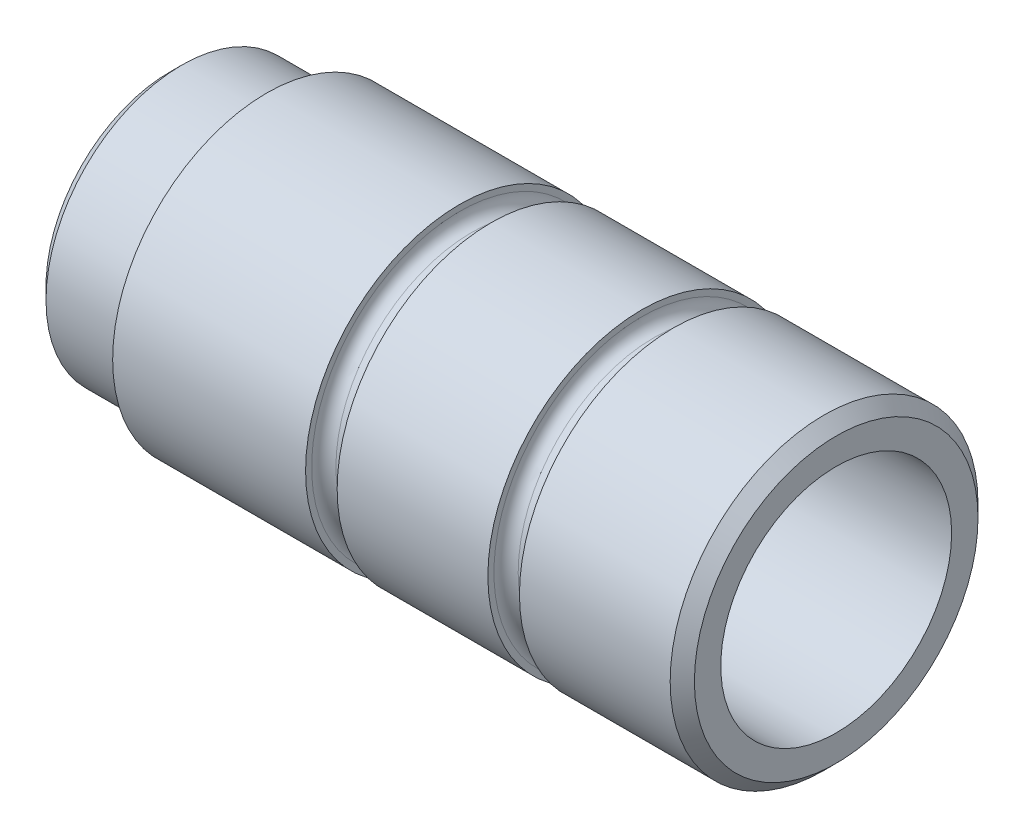
ISO-10303-21;
HEADER;
FILE_DESCRIPTION(('STEP AP214'),'2;1');
FILE_NAME('part.step','',(''),(''),'','','');
FILE_SCHEMA(('AUTOMOTIVE_DESIGN { 1 0 10303 214 1 1 1 1 }'));
ENDSEC;
DATA;
#1=APPLICATION_CONTEXT('core data for automotive mechanical design processes');
#2=APPLICATION_PROTOCOL_DEFINITION('international standard','automotive_design',2000,#1);
#3=PRODUCT_CONTEXT('',#1,'mechanical');
#4=PRODUCT('Part','Part','',(#3));
#5=PRODUCT_RELATED_PRODUCT_CATEGORY('part','',(#4));
#6=PRODUCT_DEFINITION_FORMATION('','',#4);
#7=PRODUCT_DEFINITION_CONTEXT('part definition',#1,'design');
#8=PRODUCT_DEFINITION('design','',#6,#7);
#9=PRODUCT_DEFINITION_SHAPE('','',#8);
#10=(LENGTH_UNIT() NAMED_UNIT(*) SI_UNIT(.MILLI.,.METRE.));
#11=(NAMED_UNIT(*) PLANE_ANGLE_UNIT() SI_UNIT($,.RADIAN.));
#12=(NAMED_UNIT(*) SI_UNIT($,.STERADIAN.) SOLID_ANGLE_UNIT());
#13=UNCERTAINTY_MEASURE_WITH_UNIT(LENGTH_MEASURE(1.E-05),#10,'distance_accuracy_value','');
#14=(GEOMETRIC_REPRESENTATION_CONTEXT(3) GLOBAL_UNCERTAINTY_ASSIGNED_CONTEXT((#13)) GLOBAL_UNIT_ASSIGNED_CONTEXT((#10,
#11,#12)) REPRESENTATION_CONTEXT('',''));
#15=CARTESIAN_POINT('',(0.,0.,0.));
#16=DIRECTION('',(0.,0.,1.));
#17=DIRECTION('',(1.,0.,0.));
#18=AXIS2_PLACEMENT_3D('',#15,#16,#17);
#19=CARTESIAN_POINT('',(0.,9.5249999999999,0.));
#20=DIRECTION('',(1.,0.,0.));
#21=DIRECTION('',(0.,0.,-1.));
#22=AXIS2_PLACEMENT_3D('',#19,#20,#21);
#23=PLANE('',#22);
#24=CARTESIAN_POINT('',(0.,0.,0.));
#25=DIRECTION('',(1.,0.,0.));
#26=DIRECTION('',(0.,0.,-1.));
#27=AXIS2_PLACEMENT_3D('',#24,#25,#26);
#28=CIRCLE('',#27,11.7);
#29=CARTESIAN_POINT('',(0.,0.,-11.7));
#30=VERTEX_POINT('',#29);
#31=EDGE_CURVE('E100',#30,#30,#28,.T.);
#32=ORIENTED_EDGE('',*,*,#31,.T.);
#33=EDGE_LOOP('',(#32));
#34=FACE_BOUND('',#33,.T.);
#35=CARTESIAN_POINT('',(0.,0.,0.));
#36=DIRECTION('',(1.,0.,0.));
#37=DIRECTION('',(0.,0.,-1.));
#38=AXIS2_PLACEMENT_3D('',#35,#36,#37);
#39=CIRCLE('',#38,9.525);
#40=CARTESIAN_POINT('',(0.,0.,-9.52499999999999));
#41=VERTEX_POINT('',#40);
#42=EDGE_CURVE('E10',#41,#41,#39,.T.);
#43=ORIENTED_EDGE('',*,*,#42,.F.);
#44=EDGE_LOOP('',(#43));
#45=FACE_BOUND('',#44,.T.);
#46=ADVANCED_FACE('F33',(#34,#45),#23,.T.);
#47=CARTESIAN_POINT('',(19.1682966546143,0.,0.));
#48=DIRECTION('',(1.,0.,0.));
#49=DIRECTION('',(0.,0.,-1.));
#50=AXIS2_PLACEMENT_3D('',#47,#48,#49);
#51=CYLINDRICAL_SURFACE('',#50,9.525);
#52=ORIENTED_EDGE('',*,*,#42,.T.);
#53=EDGE_LOOP('',(#52));
#54=FACE_BOUND('',#53,.T.);
#55=CARTESIAN_POINT('',(-54.9999999999999,0.,0.));
#56=DIRECTION('',(1.,0.,0.));
#57=DIRECTION('',(0.,0.,-1.));
#58=AXIS2_PLACEMENT_3D('',#55,#56,#57);
#59=CIRCLE('',#58,9.52499999999999);
#60=CARTESIAN_POINT('',(-54.9999999999999,0.,-9.52499999999999));
#61=VERTEX_POINT('',#60);
#62=EDGE_CURVE('E39',#61,#61,#59,.T.);
#63=ORIENTED_EDGE('',*,*,#62,.F.);
#64=EDGE_LOOP('',(#63));
#65=FACE_BOUND('',#64,.T.);
#66=ADVANCED_FACE('F118',(#54,#65),#51,.F.);
#67=CARTESIAN_POINT('',(-55.0000000000003,10.1999999999999,0.));
#68=DIRECTION('',(-1.,0.,0.));
#69=DIRECTION('',(0.,0.,1.));
#70=AXIS2_PLACEMENT_3D('',#67,#68,#69);
#71=PLANE('',#70);
#72=ORIENTED_EDGE('',*,*,#62,.T.);
#73=EDGE_LOOP('',(#72));
#74=FACE_BOUND('',#73,.T.);
#75=CARTESIAN_POINT('',(-54.9999999999999,0.,0.));
#76=DIRECTION('',(1.,0.,0.));
#77=DIRECTION('',(0.,0.,-1.));
#78=AXIS2_PLACEMENT_3D('',#75,#76,#77);
#79=CIRCLE('',#78,10.2);
#80=CARTESIAN_POINT('',(-54.9999999999999,0.,-10.2));
#81=VERTEX_POINT('',#80);
#82=EDGE_CURVE('E43',#81,#81,#79,.T.);
#83=ORIENTED_EDGE('',*,*,#82,.F.);
#84=EDGE_LOOP('',(#83));
#85=FACE_BOUND('',#84,.T.);
#86=ADVANCED_FACE('F122',(#74,#85),#71,.T.);
#87=CARTESIAN_POINT('',(-54.,0.,0.));
#88=DIRECTION('',(1.,0.,0.));
#89=DIRECTION('',(0.,0.,-1.));
#90=AXIS2_PLACEMENT_3D('',#87,#88,#89);
#91=CONICAL_SURFACE('',#90,11.2,0.785398163397447);
#92=ORIENTED_EDGE('',*,*,#82,.T.);
#93=EDGE_LOOP('',(#92));
#94=FACE_BOUND('',#93,.T.);
#95=CARTESIAN_POINT('',(-54.,0.,0.));
#96=DIRECTION('',(1.,0.,0.));
#97=DIRECTION('',(0.,0.,-1.));
#98=AXIS2_PLACEMENT_3D('',#95,#96,#97);
#99=CIRCLE('',#98,11.2);
#100=CARTESIAN_POINT('',(-54.,0.,-11.2));
#101=VERTEX_POINT('',#100);
#102=EDGE_CURVE('E47',#101,#101,#99,.T.);
#103=ORIENTED_EDGE('',*,*,#102,.F.);
#104=EDGE_LOOP('',(#103));
#105=FACE_BOUND('',#104,.T.);
#106=ADVANCED_FACE('F126',(#94,#105),#91,.T.);
#107=CARTESIAN_POINT('',(19.1682966546143,0.,0.));
#108=DIRECTION('',(1.,0.,0.));
#109=DIRECTION('',(0.,0.,-1.));
#110=AXIS2_PLACEMENT_3D('',#107,#108,#109);
#111=CYLINDRICAL_SURFACE('',#110,11.2);
#112=ORIENTED_EDGE('',*,*,#102,.T.);
#113=EDGE_LOOP('',(#112));
#114=FACE_BOUND('',#113,.T.);
#115=CARTESIAN_POINT('',(-47.9999999999999,0.,0.));
#116=DIRECTION('',(1.,0.,0.));
#117=DIRECTION('',(0.,0.,-1.));
#118=AXIS2_PLACEMENT_3D('',#115,#116,#117);
#119=CIRCLE('',#118,11.2);
#120=CARTESIAN_POINT('',(-47.9999999999999,0.,-11.2));
#121=VERTEX_POINT('',#120);
#122=EDGE_CURVE('E52',#121,#121,#119,.T.);
#123=ORIENTED_EDGE('',*,*,#122,.F.);
#124=EDGE_LOOP('',(#123));
#125=FACE_BOUND('',#124,.T.);
#126=ADVANCED_FACE('F132',(#114,#125),#111,.T.);
#127=CARTESIAN_POINT('',(-47.9999999999999,0.,0.));
#128=DIRECTION('',(1.,0.,0.));
#129=DIRECTION('',(0.,0.,-1.));
#130=AXIS2_PLACEMENT_3D('',#127,#128,#129);
#131=TOROIDAL_SURFACE('',#130,12.2,0.999999999999997);
#132=ORIENTED_EDGE('',*,*,#122,.T.);
#133=EDGE_LOOP('',(#132));
#134=FACE_BOUND('',#133,.T.);
#135=CARTESIAN_POINT('',(-47.0000000000002,0.,0.));
#136=DIRECTION('',(1.,0.,0.));
#137=DIRECTION('',(0.,0.,-1.));
#138=AXIS2_PLACEMENT_3D('',#135,#136,#137);
#139=CIRCLE('',#138,12.2);
#140=CARTESIAN_POINT('',(-47.0000000000002,0.,-12.1999999999999));
#141=VERTEX_POINT('',#140);
#142=EDGE_CURVE('E55',#141,#141,#139,.T.);
#143=ORIENTED_EDGE('',*,*,#142,.F.);
#144=EDGE_LOOP('',(#143));
#145=FACE_BOUND('',#144,.T.);
#146=ADVANCED_FACE('F136',(#134,#145),#131,.F.);
#147=CARTESIAN_POINT('',(-46.9999999999999,12.6999999999999,-1.66533453693773E-13));
#148=DIRECTION('',(-1.,0.,0.));
#149=DIRECTION('',(0.,0.,1.));
#150=AXIS2_PLACEMENT_3D('',#147,#148,#149);
#151=PLANE('',#150);
#152=ORIENTED_EDGE('',*,*,#142,.T.);
#153=EDGE_LOOP('',(#152));
#154=FACE_BOUND('',#153,.T.);
#155=CARTESIAN_POINT('',(-47.0000000000002,0.,0.));
#156=DIRECTION('',(1.,0.,0.));
#157=DIRECTION('',(0.,0.,-1.));
#158=AXIS2_PLACEMENT_3D('',#155,#156,#157);
#159=CIRCLE('',#158,12.7);
#160=CARTESIAN_POINT('',(-47.0000000000002,0.,-12.6999999999999));
#161=VERTEX_POINT('',#160);
#162=EDGE_CURVE('E58',#161,#161,#159,.T.);
#163=ORIENTED_EDGE('',*,*,#162,.F.);
#164=EDGE_LOOP('',(#163));
#165=FACE_BOUND('',#164,.T.);
#166=ADVANCED_FACE('F140',(#154,#165),#151,.T.);
#167=CARTESIAN_POINT('',(19.1682966546143,0.,0.));
#168=DIRECTION('',(1.,0.,0.));
#169=DIRECTION('',(0.,0.,-1.));
#170=AXIS2_PLACEMENT_3D('',#167,#168,#169);
#171=CYLINDRICAL_SURFACE('',#170,12.7);
#172=ORIENTED_EDGE('',*,*,#162,.T.);
#173=EDGE_LOOP('',(#172));
#174=FACE_BOUND('',#173,.T.);
#175=CARTESIAN_POINT('',(-31.0820712201416,-1.11022302462516E-13,0.));
#176=DIRECTION('',(1.,0.,0.));
#177=DIRECTION('',(0.,0.,-1.));
#178=AXIS2_PLACEMENT_3D('',#175,#176,#177);
#179=CIRCLE('',#178,12.7);
#180=CARTESIAN_POINT('',(-31.0820712201416,-1.11022302462516E-13,-12.7));
#181=VERTEX_POINT('',#180);
#182=EDGE_CURVE('E61',#181,#181,#179,.T.);
#183=ORIENTED_EDGE('',*,*,#182,.F.);
#184=EDGE_LOOP('',(#183));
#185=FACE_BOUND('',#184,.T.);
#186=ADVANCED_FACE('F144',(#174,#185),#171,.T.);
#187=CARTESIAN_POINT('',(-31.0820712201416,12.1999999999999,-1.11022302462516E-13));
#188=DIRECTION('',(1.,0.,0.));
#189=DIRECTION('',(0.,0.,-1.));
#190=AXIS2_PLACEMENT_3D('',#187,#188,#189);
#191=PLANE('',#190);
#192=ORIENTED_EDGE('',*,*,#182,.T.);
#193=EDGE_LOOP('',(#192));
#194=FACE_BOUND('',#193,.T.);
#195=CARTESIAN_POINT('',(-31.0820712201416,-1.11022302462516E-13,0.));
#196=DIRECTION('',(1.,0.,0.));
#197=DIRECTION('',(0.,0.,-1.));
#198=AXIS2_PLACEMENT_3D('',#195,#196,#197);
#199=CIRCLE('',#198,12.2);
#200=CARTESIAN_POINT('',(-31.0820712201416,-1.11022302462516E-13,-12.2000000000001));
#201=VERTEX_POINT('',#200);
#202=EDGE_CURVE('E64',#201,#201,#199,.T.);
#203=ORIENTED_EDGE('',*,*,#202,.F.);
#204=EDGE_LOOP('',(#203));
#205=FACE_BOUND('',#204,.T.);
#206=ADVANCED_FACE('F148',(#194,#205),#191,.T.);
#207=CARTESIAN_POINT('',(-30.0820712201418,0.,0.));
#208=DIRECTION('',(1.,0.,0.));
#209=DIRECTION('',(0.,0.,-1.));
#210=AXIS2_PLACEMENT_3D('',#207,#208,#209);
#211=TOROIDAL_SURFACE('',#210,12.2,1.00000000000001);
#212=ORIENTED_EDGE('',*,*,#202,.T.);
#213=EDGE_LOOP('',(#212));
#214=FACE_BOUND('',#213,.T.);
#215=CARTESIAN_POINT('',(-30.0820712201418,0.,0.));
#216=DIRECTION('',(1.,0.,0.));
#217=DIRECTION('',(0.,0.,-1.));
#218=AXIS2_PLACEMENT_3D('',#215,#216,#217);
#219=CIRCLE('',#218,11.2);
#220=CARTESIAN_POINT('',(-30.0820712201418,0.,-11.2));
#221=VERTEX_POINT('',#220);
#222=EDGE_CURVE('E67',#221,#221,#219,.T.);
#223=ORIENTED_EDGE('',*,*,#222,.F.);
#224=EDGE_LOOP('',(#223));
#225=FACE_BOUND('',#224,.T.);
#226=ADVANCED_FACE('F152',(#214,#225),#211,.F.);
#227=CARTESIAN_POINT('',(19.1682966546143,0.,0.));
#228=DIRECTION('',(1.,0.,0.));
#229=DIRECTION('',(0.,0.,-1.));
#230=AXIS2_PLACEMENT_3D('',#227,#228,#229);
#231=CYLINDRICAL_SURFACE('',#230,11.2);
#232=ORIENTED_EDGE('',*,*,#222,.T.);
#233=EDGE_LOOP('',(#232));
#234=FACE_BOUND('',#233,.T.);
#235=CARTESIAN_POINT('',(-29.4770978146133,-1.11022302462516E-13,0.));
#236=DIRECTION('',(1.,0.,0.));
#237=DIRECTION('',(0.,0.,-1.));
#238=AXIS2_PLACEMENT_3D('',#235,#236,#237);
#239=CIRCLE('',#238,11.2);
#240=CARTESIAN_POINT('',(-29.4770978146133,-1.11022302462516E-13,-11.2));
#241=VERTEX_POINT('',#240);
#242=EDGE_CURVE('E70',#241,#241,#239,.T.);
#243=ORIENTED_EDGE('',*,*,#242,.F.);
#244=EDGE_LOOP('',(#243));
#245=FACE_BOUND('',#244,.T.);
#246=ADVANCED_FACE('F156',(#234,#245),#231,.T.);
#247=CARTESIAN_POINT('',(-29.4770978146133,-1.11022302462516E-13,0.));
#248=DIRECTION('',(1.,0.,0.));
#249=DIRECTION('',(0.,0.,-1.));
#250=AXIS2_PLACEMENT_3D('',#247,#248,#249);
#251=TOROIDAL_SURFACE('',#250,12.2,0.999999999999999);
#252=ORIENTED_EDGE('',*,*,#242,.T.);
#253=EDGE_LOOP('',(#252));
#254=FACE_BOUND('',#253,.T.);
#255=CARTESIAN_POINT('',(-28.4770978146135,0.,0.));
#256=DIRECTION('',(1.,0.,0.));
#257=DIRECTION('',(0.,0.,-1.));
#258=AXIS2_PLACEMENT_3D('',#255,#256,#257);
#259=CIRCLE('',#258,12.2);
#260=CARTESIAN_POINT('',(-28.4770978146135,0.,-12.2));
#261=VERTEX_POINT('',#260);
#262=EDGE_CURVE('E73',#261,#261,#259,.T.);
#263=ORIENTED_EDGE('',*,*,#262,.F.);
#264=EDGE_LOOP('',(#263));
#265=FACE_BOUND('',#264,.T.);
#266=ADVANCED_FACE('F160',(#254,#265),#251,.F.);
#267=CARTESIAN_POINT('',(-28.4770978146133,12.6999999999999,0.));
#268=DIRECTION('',(-1.,0.,0.));
#269=DIRECTION('',(0.,0.,1.));
#270=AXIS2_PLACEMENT_3D('',#267,#268,#269);
#271=PLANE('',#270);
#272=ORIENTED_EDGE('',*,*,#262,.T.);
#273=EDGE_LOOP('',(#272));
#274=FACE_BOUND('',#273,.T.);
#275=CARTESIAN_POINT('',(-28.4770978146135,0.,0.));
#276=DIRECTION('',(1.,0.,0.));
#277=DIRECTION('',(0.,0.,-1.));
#278=AXIS2_PLACEMENT_3D('',#275,#276,#277);
#279=CIRCLE('',#278,12.7);
#280=CARTESIAN_POINT('',(-28.4770978146135,0.,-12.7));
#281=VERTEX_POINT('',#280);
#282=EDGE_CURVE('E76',#281,#281,#279,.T.);
#283=ORIENTED_EDGE('',*,*,#282,.F.);
#284=EDGE_LOOP('',(#283));
#285=FACE_BOUND('',#284,.T.);
#286=ADVANCED_FACE('F164',(#274,#285),#271,.T.);
#287=CARTESIAN_POINT('',(19.1682966546143,0.,0.));
#288=DIRECTION('',(1.,0.,0.));
#289=DIRECTION('',(0.,0.,-1.));
#290=AXIS2_PLACEMENT_3D('',#287,#288,#289);
#291=CYLINDRICAL_SURFACE('',#290,12.7);
#292=ORIENTED_EDGE('',*,*,#282,.T.);
#293=EDGE_LOOP('',(#292));
#294=FACE_BOUND('',#293,.T.);
#295=CARTESIAN_POINT('',(-16.0410356100708,0.,-1.11022302462516E-13));
#296=DIRECTION('',(1.,0.,0.));
#297=DIRECTION('',(0.,0.,-1.));
#298=AXIS2_PLACEMENT_3D('',#295,#296,#297);
#299=CIRCLE('',#298,12.7);
#300=CARTESIAN_POINT('',(-16.0410356100708,0.,-12.7000000000001));
#301=VERTEX_POINT('',#300);
#302=EDGE_CURVE('E79',#301,#301,#299,.T.);
#303=ORIENTED_EDGE('',*,*,#302,.F.);
#304=EDGE_LOOP('',(#303));
#305=FACE_BOUND('',#304,.T.);
#306=ADVANCED_FACE('F168',(#294,#305),#291,.T.);
#307=CARTESIAN_POINT('',(-16.041035610071,12.2,0.));
#308=DIRECTION('',(1.,0.,0.));
#309=DIRECTION('',(0.,0.,-1.));
#310=AXIS2_PLACEMENT_3D('',#307,#308,#309);
#311=PLANE('',#310);
#312=ORIENTED_EDGE('',*,*,#302,.T.);
#313=EDGE_LOOP('',(#312));
#314=FACE_BOUND('',#313,.T.);
#315=CARTESIAN_POINT('',(-16.0410356100708,0.,-1.11022302462516E-13));
#316=DIRECTION('',(1.,0.,0.));
#317=DIRECTION('',(0.,0.,-1.));
#318=AXIS2_PLACEMENT_3D('',#315,#316,#317);
#319=CIRCLE('',#318,12.2);
#320=CARTESIAN_POINT('',(-16.0410356100708,0.,-12.2000000000001));
#321=VERTEX_POINT('',#320);
#322=EDGE_CURVE('E82',#321,#321,#319,.T.);
#323=ORIENTED_EDGE('',*,*,#322,.F.);
#324=EDGE_LOOP('',(#323));
#325=FACE_BOUND('',#324,.T.);
#326=ADVANCED_FACE('F172',(#314,#325),#311,.T.);
#327=CARTESIAN_POINT('',(-15.0410356100709,0.,0.));
#328=DIRECTION('',(1.,0.,0.));
#329=DIRECTION('',(0.,0.,-1.));
#330=AXIS2_PLACEMENT_3D('',#327,#328,#329);
#331=TOROIDAL_SURFACE('',#330,12.2,1.);
#332=ORIENTED_EDGE('',*,*,#322,.T.);
#333=EDGE_LOOP('',(#332));
#334=FACE_BOUND('',#333,.T.);
#335=CARTESIAN_POINT('',(-15.0410356100709,0.,0.));
#336=DIRECTION('',(1.,0.,0.));
#337=DIRECTION('',(0.,0.,-1.));
#338=AXIS2_PLACEMENT_3D('',#335,#336,#337);
#339=CIRCLE('',#338,11.2);
#340=CARTESIAN_POINT('',(-15.0410356100709,0.,-11.2));
#341=VERTEX_POINT('',#340);
#342=EDGE_CURVE('E85',#341,#341,#339,.T.);
#343=ORIENTED_EDGE('',*,*,#342,.F.);
#344=EDGE_LOOP('',(#343));
#345=FACE_BOUND('',#344,.T.);
#346=ADVANCED_FACE('F176',(#334,#345),#331,.F.);
#347=CARTESIAN_POINT('',(19.1682966546143,0.,0.));
#348=DIRECTION('',(1.,0.,0.));
#349=DIRECTION('',(0.,0.,-1.));
#350=AXIS2_PLACEMENT_3D('',#347,#348,#349);
#351=CYLINDRICAL_SURFACE('',#350,11.2);
#352=ORIENTED_EDGE('',*,*,#342,.T.);
#353=EDGE_LOOP('',(#352));
#354=FACE_BOUND('',#353,.T.);
#355=CARTESIAN_POINT('',(-14.4360622045424,0.,0.));
#356=DIRECTION('',(1.,0.,0.));
#357=DIRECTION('',(0.,0.,-1.));
#358=AXIS2_PLACEMENT_3D('',#355,#356,#357);
#359=CIRCLE('',#358,11.2);
#360=CARTESIAN_POINT('',(-14.4360622045424,0.,-11.2));
#361=VERTEX_POINT('',#360);
#362=EDGE_CURVE('E88',#361,#361,#359,.T.);
#363=ORIENTED_EDGE('',*,*,#362,.F.);
#364=EDGE_LOOP('',(#363));
#365=FACE_BOUND('',#364,.T.);
#366=ADVANCED_FACE('F180',(#354,#365),#351,.T.);
#367=CARTESIAN_POINT('',(-14.4360622045424,0.,0.));
#368=DIRECTION('',(1.,0.,0.));
#369=DIRECTION('',(0.,0.,-1.));
#370=AXIS2_PLACEMENT_3D('',#367,#368,#369);
#371=TOROIDAL_SURFACE('',#370,12.2,1.);
#372=ORIENTED_EDGE('',*,*,#362,.T.);
#373=EDGE_LOOP('',(#372));
#374=FACE_BOUND('',#373,.T.);
#375=CARTESIAN_POINT('',(-13.4360622045425,0.,0.));
#376=DIRECTION('',(1.,0.,0.));
#377=DIRECTION('',(0.,0.,-1.));
#378=AXIS2_PLACEMENT_3D('',#375,#376,#377);
#379=CIRCLE('',#378,12.2);
#380=CARTESIAN_POINT('',(-13.4360622045425,0.,-12.2000000000001));
#381=VERTEX_POINT('',#380);
#382=EDGE_CURVE('E91',#381,#381,#379,.T.);
#383=ORIENTED_EDGE('',*,*,#382,.F.);
#384=EDGE_LOOP('',(#383));
#385=FACE_BOUND('',#384,.T.);
#386=ADVANCED_FACE('F184',(#374,#385),#371,.F.);
#387=CARTESIAN_POINT('',(-13.4360622045424,12.7,0.));
#388=DIRECTION('',(-1.,0.,0.));
#389=DIRECTION('',(0.,0.,1.));
#390=AXIS2_PLACEMENT_3D('',#387,#388,#389);
#391=PLANE('',#390);
#392=ORIENTED_EDGE('',*,*,#382,.T.);
#393=EDGE_LOOP('',(#392));
#394=FACE_BOUND('',#393,.T.);
#395=CARTESIAN_POINT('',(-13.4360622045425,0.,0.));
#396=DIRECTION('',(1.,0.,0.));
#397=DIRECTION('',(0.,0.,-1.));
#398=AXIS2_PLACEMENT_3D('',#395,#396,#397);
#399=CIRCLE('',#398,12.7);
#400=CARTESIAN_POINT('',(-13.4360622045425,0.,-12.7));
#401=VERTEX_POINT('',#400);
#402=EDGE_CURVE('E94',#401,#401,#399,.T.);
#403=ORIENTED_EDGE('',*,*,#402,.F.);
#404=EDGE_LOOP('',(#403));
#405=FACE_BOUND('',#404,.T.);
#406=ADVANCED_FACE('F114',(#394,#405),#391,.T.);
#407=CARTESIAN_POINT('',(19.1682966546143,0.,0.));
#408=DIRECTION('',(1.,0.,0.));
#409=DIRECTION('',(0.,0.,-1.));
#410=AXIS2_PLACEMENT_3D('',#407,#408,#409);
#411=CYLINDRICAL_SURFACE('',#410,12.7);
#412=ORIENTED_EDGE('',*,*,#402,.T.);
#413=EDGE_LOOP('',(#412));
#414=FACE_BOUND('',#413,.T.);
#415=CARTESIAN_POINT('',(-0.999999999999779,0.,0.));
#416=DIRECTION('',(1.,0.,0.));
#417=DIRECTION('',(0.,0.,-1.));
#418=AXIS2_PLACEMENT_3D('',#415,#416,#417);
#419=CIRCLE('',#418,12.7);
#420=CARTESIAN_POINT('',(-0.999999999999779,0.,-12.7));
#421=VERTEX_POINT('',#420);
#422=EDGE_CURVE('E97',#421,#421,#419,.T.);
#423=ORIENTED_EDGE('',*,*,#422,.F.);
#424=EDGE_LOOP('',(#423));
#425=FACE_BOUND('',#424,.T.);
#426=ADVANCED_FACE('F108',(#414,#425),#411,.T.);
#427=CARTESIAN_POINT('',(0.,0.,0.));
#428=DIRECTION('',(-1.,0.,0.));
#429=DIRECTION('',(0.,0.,1.));
#430=AXIS2_PLACEMENT_3D('',#427,#428,#429);
#431=CONICAL_SURFACE('',#430,11.7,0.785398163397447);
#432=ORIENTED_EDGE('',*,*,#422,.T.);
#433=EDGE_LOOP('',(#432));
#434=FACE_BOUND('',#433,.T.);
#435=ORIENTED_EDGE('',*,*,#31,.F.);
#436=EDGE_LOOP('',(#435));
#437=FACE_BOUND('',#436,.T.);
#438=ADVANCED_FACE('F106',(#434,#437),#431,.T.);
#439=CLOSED_SHELL('',(#46,#66,#86,#106,#126,#146,#166,#186,#206,#226,#246,#266,#286,#306,#326,
#346,#366,#386,#406,#426,#438));
#440=MANIFOLD_SOLID_BREP('B2',#439);
#441=ADVANCED_BREP_SHAPE_REPRESENTATION('',(#18,#440),#14);
#442=SHAPE_DEFINITION_REPRESENTATION(#9,#441);
ENDSEC;
END-ISO-10303-21;
